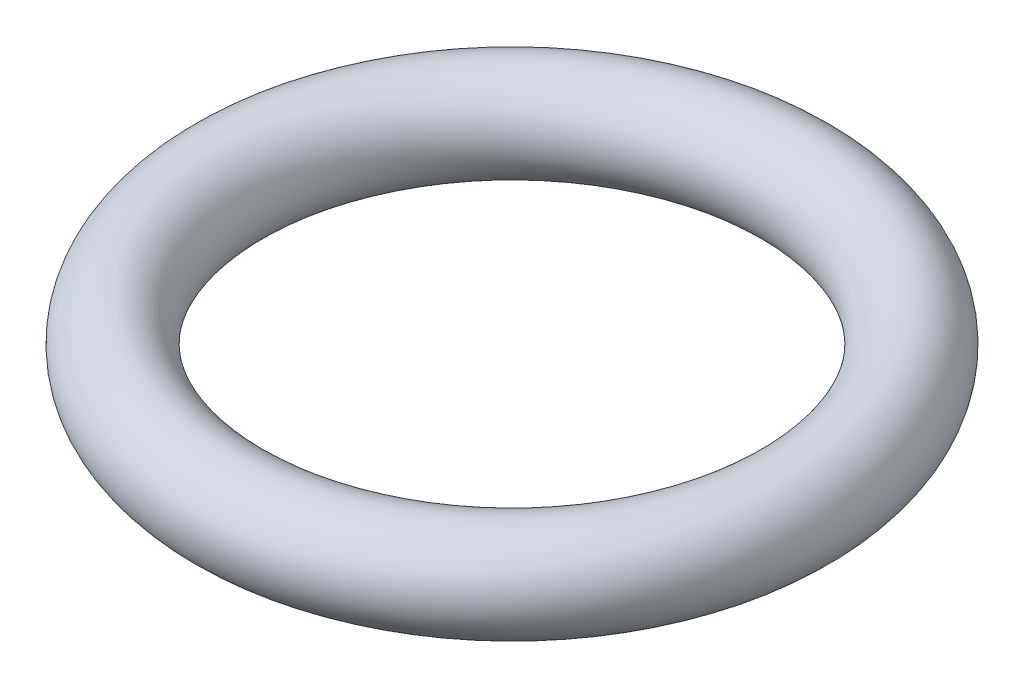
ISO-10303-21;
HEADER;
FILE_DESCRIPTION(('STEP AP214'),'2;1');
FILE_NAME('part.step','',(''),(''),'','','');
FILE_SCHEMA(('AUTOMOTIVE_DESIGN { 1 0 10303 214 1 1 1 1 }'));
ENDSEC;
DATA;
#1=APPLICATION_CONTEXT('core data for automotive mechanical design processes');
#2=APPLICATION_PROTOCOL_DEFINITION('international standard','automotive_design',2000,#1);
#3=PRODUCT_CONTEXT('',#1,'mechanical');
#4=PRODUCT('Part','Part','',(#3));
#5=PRODUCT_RELATED_PRODUCT_CATEGORY('part','',(#4));
#6=PRODUCT_DEFINITION_FORMATION('','',#4);
#7=PRODUCT_DEFINITION_CONTEXT('part definition',#1,'design');
#8=PRODUCT_DEFINITION('design','',#6,#7);
#9=PRODUCT_DEFINITION_SHAPE('','',#8);
#10=(LENGTH_UNIT() NAMED_UNIT(*) SI_UNIT(.MILLI.,.METRE.));
#11=(NAMED_UNIT(*) PLANE_ANGLE_UNIT() SI_UNIT($,.RADIAN.));
#12=(NAMED_UNIT(*) SI_UNIT($,.STERADIAN.) SOLID_ANGLE_UNIT());
#13=UNCERTAINTY_MEASURE_WITH_UNIT(LENGTH_MEASURE(1.E-05),#10,'distance_accuracy_value','');
#14=(GEOMETRIC_REPRESENTATION_CONTEXT(3) GLOBAL_UNCERTAINTY_ASSIGNED_CONTEXT((#13)) GLOBAL_UNIT_ASSIGNED_CONTEXT((#10,
#11,#12)) REPRESENTATION_CONTEXT('',''));
#15=CARTESIAN_POINT('',(0.,0.,0.));
#16=DIRECTION('',(0.,0.,1.));
#17=DIRECTION('',(1.,0.,0.));
#18=AXIS2_PLACEMENT_3D('',#15,#16,#17);
#19=CARTESIAN_POINT('',(0.,0.,0.));
#20=DIRECTION('',(0.,-1.,0.));
#21=DIRECTION('',(0.,0.,-1.));
#22=AXIS2_PLACEMENT_3D('',#19,#20,#21);
#23=TOROIDAL_SURFACE('',#22,152.4,25.4);
#24=CARTESIAN_POINT('',(0.,0.,-177.8));
#25=VERTEX_POINT('',#24);
#26=VERTEX_LOOP('',#25);
#27=FACE_BOUND('',#26,.T.);
#28=ADVANCED_FACE('F33',(#27),#23,.T.);
#29=CLOSED_SHELL('',(#28));
#30=MANIFOLD_SOLID_BREP('B2',#29);
#31=ADVANCED_BREP_SHAPE_REPRESENTATION('',(#18,#30),#14);
#32=SHAPE_DEFINITION_REPRESENTATION(#9,#31);
ENDSEC;
END-ISO-10303-21;
